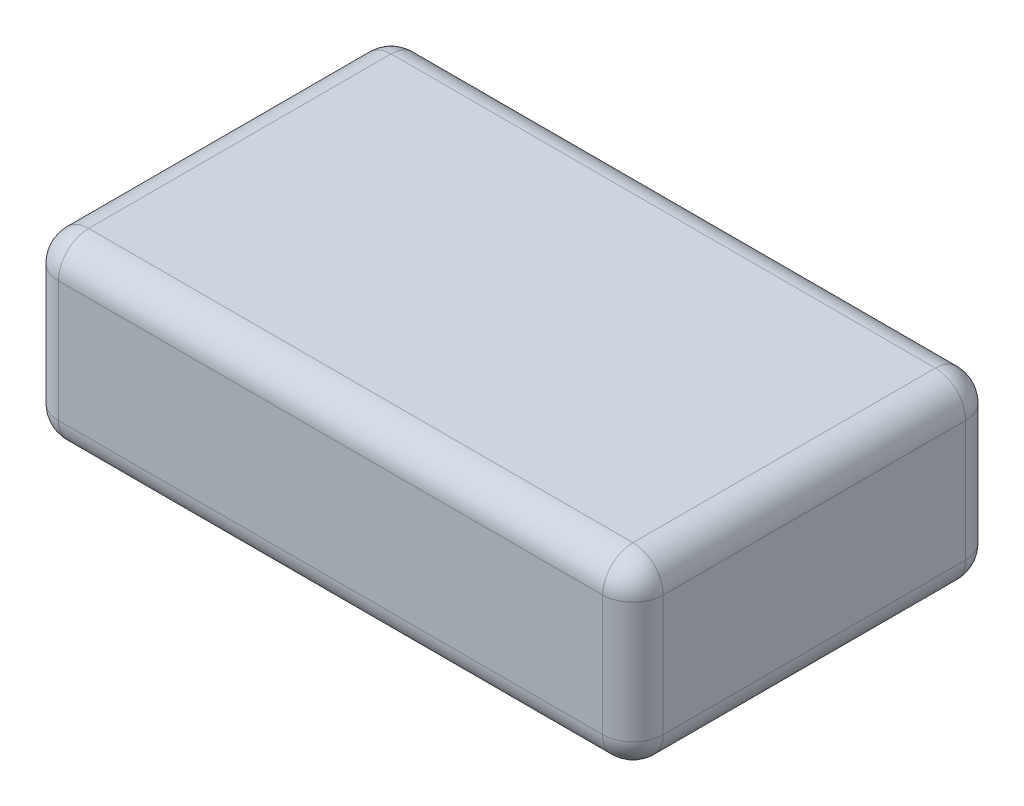
ISO-10303-21;
HEADER;
FILE_DESCRIPTION(('STEP AP214'),'2;1');
FILE_NAME('part.step','',(''),(''),'','','');
FILE_SCHEMA(('AUTOMOTIVE_DESIGN { 1 0 10303 214 1 1 1 1 }'));
ENDSEC;
DATA;
#1=APPLICATION_CONTEXT('core data for automotive mechanical design processes');
#2=APPLICATION_PROTOCOL_DEFINITION('international standard','automotive_design',2000,#1);
#3=PRODUCT_CONTEXT('',#1,'mechanical');
#4=PRODUCT('Part','Part','',(#3));
#5=PRODUCT_RELATED_PRODUCT_CATEGORY('part','',(#4));
#6=PRODUCT_DEFINITION_FORMATION('','',#4);
#7=PRODUCT_DEFINITION_CONTEXT('part definition',#1,'design');
#8=PRODUCT_DEFINITION('design','',#6,#7);
#9=PRODUCT_DEFINITION_SHAPE('','',#8);
#10=(LENGTH_UNIT() NAMED_UNIT(*) SI_UNIT(.MILLI.,.METRE.));
#11=(NAMED_UNIT(*) PLANE_ANGLE_UNIT() SI_UNIT($,.RADIAN.));
#12=(NAMED_UNIT(*) SI_UNIT($,.STERADIAN.) SOLID_ANGLE_UNIT());
#13=UNCERTAINTY_MEASURE_WITH_UNIT(LENGTH_MEASURE(1.E-05),#10,'distance_accuracy_value','');
#14=(GEOMETRIC_REPRESENTATION_CONTEXT(3) GLOBAL_UNCERTAINTY_ASSIGNED_CONTEXT((#13)) GLOBAL_UNIT_ASSIGNED_CONTEXT((#10,
#11,#12)) REPRESENTATION_CONTEXT('',''));
#15=CARTESIAN_POINT('',(0.,0.,0.));
#16=DIRECTION('',(0.,0.,1.));
#17=DIRECTION('',(1.,0.,0.));
#18=AXIS2_PLACEMENT_3D('',#15,#16,#17);
#19=CARTESIAN_POINT('',(31.75,19.05,-19.05));
#20=DIRECTION('',(-1.,0.,0.));
#21=DIRECTION('',(0.,0.,1.));
#22=AXIS2_PLACEMENT_3D('',#19,#20,#21);
#23=PLANE('',#22);
#24=DIRECTION('',(0.,-1.,0.));
#25=VECTOR('',#24,1.);
#26=CARTESIAN_POINT('',(31.75,19.05,-15.875));
#27=LINE('',#26,#25);
#28=CARTESIAN_POINT('',(31.75,3.175,-15.875));
#29=VERTEX_POINT('',#28);
#30=CARTESIAN_POINT('',(31.75,15.875,-15.875));
#31=VERTEX_POINT('',#30);
#32=EDGE_CURVE('E183',#29,#31,#27,.F.);
#33=ORIENTED_EDGE('',*,*,#32,.T.);
#34=DIRECTION('',(0.,0.,-1.));
#35=VECTOR('',#34,1.);
#36=CARTESIAN_POINT('',(31.75,15.875,19.05));
#37=LINE('',#36,#35);
#38=CARTESIAN_POINT('',(31.75,15.875,15.875));
#39=VERTEX_POINT('',#38);
#40=EDGE_CURVE('E185',#31,#39,#37,.F.);
#41=ORIENTED_EDGE('',*,*,#40,.T.);
#42=DIRECTION('',(0.,-1.,0.));
#43=VECTOR('',#42,1.);
#44=CARTESIAN_POINT('',(31.75,19.05,15.875));
#45=LINE('',#44,#43);
#46=CARTESIAN_POINT('',(31.75,3.175,15.875));
#47=VERTEX_POINT('',#46);
#48=EDGE_CURVE('E181',#39,#47,#45,.T.);
#49=ORIENTED_EDGE('',*,*,#48,.T.);
#50=DIRECTION('',(0.,0.,-1.));
#51=VECTOR('',#50,1.);
#52=CARTESIAN_POINT('',(31.75,3.175,-19.05));
#53=LINE('',#52,#51);
#54=EDGE_CURVE('E179',#47,#29,#53,.T.);
#55=ORIENTED_EDGE('',*,*,#54,.T.);
#56=EDGE_LOOP('',(#33,#41,#49,#55));
#57=FACE_BOUND('',#56,.T.);
#58=ADVANCED_FACE('F36',(#57),#23,.F.);
#59=CARTESIAN_POINT('',(-31.75,19.05,-19.05));
#60=DIRECTION('',(0.,0.,1.));
#61=DIRECTION('',(1.,0.,0.));
#62=AXIS2_PLACEMENT_3D('',#59,#60,#61);
#63=PLANE('',#62);
#64=DIRECTION('',(0.,-1.,0.));
#65=VECTOR('',#64,1.);
#66=CARTESIAN_POINT('',(-28.575,19.05,-19.05));
#67=LINE('',#66,#65);
#68=CARTESIAN_POINT('',(-28.575,3.175,-19.05));
#69=VERTEX_POINT('',#68);
#70=CARTESIAN_POINT('',(-28.575,15.875,-19.05));
#71=VERTEX_POINT('',#70);
#72=EDGE_CURVE('E174',#69,#71,#67,.F.);
#73=ORIENTED_EDGE('',*,*,#72,.T.);
#74=DIRECTION('',(-1.,0.,0.));
#75=VECTOR('',#74,1.);
#76=CARTESIAN_POINT('',(31.75,15.875,-19.05));
#77=LINE('',#76,#75);
#78=CARTESIAN_POINT('',(28.575,15.875,-19.05));
#79=VERTEX_POINT('',#78);
#80=EDGE_CURVE('E176',#71,#79,#77,.F.);
#81=ORIENTED_EDGE('',*,*,#80,.T.);
#82=DIRECTION('',(0.,-1.,0.));
#83=VECTOR('',#82,1.);
#84=CARTESIAN_POINT('',(28.575,19.05,-19.05));
#85=LINE('',#84,#83);
#86=CARTESIAN_POINT('',(28.575,3.175,-19.05));
#87=VERTEX_POINT('',#86);
#88=EDGE_CURVE('E172',#79,#87,#85,.T.);
#89=ORIENTED_EDGE('',*,*,#88,.T.);
#90=DIRECTION('',(-1.,0.,0.));
#91=VECTOR('',#90,1.);
#92=CARTESIAN_POINT('',(-31.75,3.175,-19.05));
#93=LINE('',#92,#91);
#94=EDGE_CURVE('E170',#87,#69,#93,.T.);
#95=ORIENTED_EDGE('',*,*,#94,.T.);
#96=EDGE_LOOP('',(#73,#81,#89,#95));
#97=FACE_BOUND('',#96,.T.);
#98=ADVANCED_FACE('F286',(#97),#63,.F.);
#99=CARTESIAN_POINT('',(-31.75,19.05,-19.05));
#100=DIRECTION('',(1.,0.,0.));
#101=DIRECTION('',(0.,0.,-1.));
#102=AXIS2_PLACEMENT_3D('',#99,#100,#101);
#103=PLANE('',#102);
#104=DIRECTION('',(0.,-1.,0.));
#105=VECTOR('',#104,1.);
#106=CARTESIAN_POINT('',(-31.75,19.05,15.875));
#107=LINE('',#106,#105);
#108=CARTESIAN_POINT('',(-31.75,3.175,15.875));
#109=VERTEX_POINT('',#108);
#110=CARTESIAN_POINT('',(-31.75,15.875,15.875));
#111=VERTEX_POINT('',#110);
#112=EDGE_CURVE('E161',#109,#111,#107,.F.);
#113=ORIENTED_EDGE('',*,*,#112,.T.);
#114=DIRECTION('',(0.,0.,1.));
#115=VECTOR('',#114,1.);
#116=CARTESIAN_POINT('',(-31.75,15.875,-19.05));
#117=LINE('',#116,#115);
#118=CARTESIAN_POINT('',(-31.75,15.875,-15.875));
#119=VERTEX_POINT('',#118);
#120=EDGE_CURVE('E131',#111,#119,#117,.F.);
#121=ORIENTED_EDGE('',*,*,#120,.T.);
#122=DIRECTION('',(0.,-1.,0.));
#123=VECTOR('',#122,1.);
#124=CARTESIAN_POINT('',(-31.75,19.05,-15.875));
#125=LINE('',#124,#123);
#126=CARTESIAN_POINT('',(-31.75,3.175,-15.875));
#127=VERTEX_POINT('',#126);
#128=EDGE_CURVE('E167',#119,#127,#125,.T.);
#129=ORIENTED_EDGE('',*,*,#128,.T.);
#130=DIRECTION('',(0.,0.,1.));
#131=VECTOR('',#130,1.);
#132=CARTESIAN_POINT('',(-31.75,3.175,-19.05));
#133=LINE('',#132,#131);
#134=EDGE_CURVE('E159',#127,#109,#133,.T.);
#135=ORIENTED_EDGE('',*,*,#134,.T.);
#136=EDGE_LOOP('',(#113,#121,#129,#135));
#137=FACE_BOUND('',#136,.T.);
#138=ADVANCED_FACE('F321',(#137),#103,.F.);
#139=CARTESIAN_POINT('',(-31.75,19.05,19.05));
#140=DIRECTION('',(0.,0.,-1.));
#141=DIRECTION('',(-1.,0.,0.));
#142=AXIS2_PLACEMENT_3D('',#139,#140,#141);
#143=PLANE('',#142);
#144=DIRECTION('',(1.,0.,0.));
#145=VECTOR('',#144,1.);
#146=CARTESIAN_POINT('',(-31.75,15.875,19.05));
#147=LINE('',#146,#145);
#148=CARTESIAN_POINT('',(28.575,15.875,19.05));
#149=VERTEX_POINT('',#148);
#150=CARTESIAN_POINT('',(-28.575,15.875,19.05));
#151=VERTEX_POINT('',#150);
#152=EDGE_CURVE('E192',#149,#151,#147,.F.);
#153=ORIENTED_EDGE('',*,*,#152,.T.);
#154=DIRECTION('',(0.,-1.,0.));
#155=VECTOR('',#154,1.);
#156=CARTESIAN_POINT('',(-28.575,19.05,19.05));
#157=LINE('',#156,#155);
#158=CARTESIAN_POINT('',(-28.575,3.175,19.05));
#159=VERTEX_POINT('',#158);
#160=EDGE_CURVE('E194',#151,#159,#157,.T.);
#161=ORIENTED_EDGE('',*,*,#160,.T.);
#162=DIRECTION('',(1.,0.,0.));
#163=VECTOR('',#162,1.);
#164=CARTESIAN_POINT('',(-31.75,3.175,19.05));
#165=LINE('',#164,#163);
#166=CARTESIAN_POINT('',(28.575,3.175,19.05));
#167=VERTEX_POINT('',#166);
#168=EDGE_CURVE('E188',#159,#167,#165,.T.);
#169=ORIENTED_EDGE('',*,*,#168,.T.);
#170=DIRECTION('',(0.,-1.,0.));
#171=VECTOR('',#170,1.);
#172=CARTESIAN_POINT('',(28.575,19.05,19.05));
#173=LINE('',#172,#171);
#174=EDGE_CURVE('E190',#167,#149,#173,.F.);
#175=ORIENTED_EDGE('',*,*,#174,.T.);
#176=EDGE_LOOP('',(#153,#161,#169,#175));
#177=FACE_BOUND('',#176,.T.);
#178=ADVANCED_FACE('F323',(#177),#143,.F.);
#179=CARTESIAN_POINT('',(0.,19.05,0.));
#180=DIRECTION('',(0.,1.,0.));
#181=DIRECTION('',(0.,0.,1.));
#182=AXIS2_PLACEMENT_3D('',#179,#180,#181);
#183=PLANE('',#182);
#184=DIRECTION('',(-1.,0.,0.));
#185=VECTOR('',#184,1.);
#186=CARTESIAN_POINT('',(-31.75,19.05,-15.875));
#187=LINE('',#186,#185);
#188=CARTESIAN_POINT('',(28.575,19.05,-15.875));
#189=VERTEX_POINT('',#188);
#190=CARTESIAN_POINT('',(-28.575,19.05,-15.875));
#191=VERTEX_POINT('',#190);
#192=EDGE_CURVE('E157',#189,#191,#187,.T.);
#193=ORIENTED_EDGE('',*,*,#192,.T.);
#194=DIRECTION('',(0.,0.,1.));
#195=VECTOR('',#194,1.);
#196=CARTESIAN_POINT('',(-28.575,19.05,19.05));
#197=LINE('',#196,#195);
#198=CARTESIAN_POINT('',(-28.575,19.05,15.875));
#199=VERTEX_POINT('',#198);
#200=EDGE_CURVE('E129',#191,#199,#197,.T.);
#201=ORIENTED_EDGE('',*,*,#200,.T.);
#202=DIRECTION('',(1.,0.,0.));
#203=VECTOR('',#202,1.);
#204=CARTESIAN_POINT('',(31.75,19.05,15.875));
#205=LINE('',#204,#203);
#206=CARTESIAN_POINT('',(28.575,19.05,15.875));
#207=VERTEX_POINT('',#206);
#208=EDGE_CURVE('E147',#199,#207,#205,.T.);
#209=ORIENTED_EDGE('',*,*,#208,.T.);
#210=DIRECTION('',(0.,0.,-1.));
#211=VECTOR('',#210,1.);
#212=CARTESIAN_POINT('',(28.575,19.05,-19.05));
#213=LINE('',#212,#211);
#214=EDGE_CURVE('E153',#207,#189,#213,.T.);
#215=ORIENTED_EDGE('',*,*,#214,.T.);
#216=EDGE_LOOP('',(#193,#201,#209,#215));
#217=FACE_BOUND('',#216,.T.);
#218=ADVANCED_FACE('F155',(#217),#183,.T.);
#219=CARTESIAN_POINT('',(0.,0.,0.));
#220=DIRECTION('',(0.,1.,0.));
#221=DIRECTION('',(0.,0.,1.));
#222=AXIS2_PLACEMENT_3D('',#219,#220,#221);
#223=PLANE('',#222);
#224=DIRECTION('',(0.,0.,1.));
#225=VECTOR('',#224,1.);
#226=CARTESIAN_POINT('',(-28.575,0.,0.));
#227=LINE('',#226,#225);
#228=CARTESIAN_POINT('',(-28.575,0.,15.875));
#229=VERTEX_POINT('',#228);
#230=CARTESIAN_POINT('',(-28.575,0.,-15.875));
#231=VERTEX_POINT('',#230);
#232=EDGE_CURVE('E45',#229,#231,#227,.F.);
#233=ORIENTED_EDGE('',*,*,#232,.T.);
#234=DIRECTION('',(-1.,0.,0.));
#235=VECTOR('',#234,1.);
#236=CARTESIAN_POINT('',(0.,0.,-15.875));
#237=LINE('',#236,#235);
#238=CARTESIAN_POINT('',(28.575,0.,-15.875));
#239=VERTEX_POINT('',#238);
#240=EDGE_CURVE('E11',#231,#239,#237,.F.);
#241=ORIENTED_EDGE('',*,*,#240,.T.);
#242=DIRECTION('',(0.,0.,-1.));
#243=VECTOR('',#242,1.);
#244=CARTESIAN_POINT('',(28.575,0.,0.));
#245=LINE('',#244,#243);
#246=CARTESIAN_POINT('',(28.575,0.,15.875));
#247=VERTEX_POINT('',#246);
#248=EDGE_CURVE('E197',#239,#247,#245,.F.);
#249=ORIENTED_EDGE('',*,*,#248,.T.);
#250=DIRECTION('',(1.,0.,0.));
#251=VECTOR('',#250,1.);
#252=CARTESIAN_POINT('',(0.,0.,15.875));
#253=LINE('',#252,#251);
#254=EDGE_CURVE('E56',#247,#229,#253,.F.);
#255=ORIENTED_EDGE('',*,*,#254,.T.);
#256=EDGE_LOOP('',(#233,#241,#249,#255));
#257=FACE_BOUND('',#256,.T.);
#258=ADVANCED_FACE('F266',(#257),#223,.F.);
#259=CARTESIAN_POINT('',(28.575,3.175,-19.05));
#260=DIRECTION('',(0.,0.,-1.));
#261=DIRECTION('',(-1.,0.,0.));
#262=AXIS2_PLACEMENT_3D('',#259,#260,#261);
#263=CYLINDRICAL_SURFACE('',#262,3.175);
#264=CARTESIAN_POINT('',(28.575,3.175,-15.875));
#265=DIRECTION('',(0.,0.,-1.));
#266=DIRECTION('',(-1.,0.,0.));
#267=AXIS2_PLACEMENT_3D('',#264,#265,#266);
#268=CIRCLE('',#267,3.175);
#269=EDGE_CURVE('E40',#29,#239,#268,.T.);
#270=ORIENTED_EDGE('',*,*,#269,.F.);
#271=ORIENTED_EDGE('',*,*,#54,.F.);
#272=CARTESIAN_POINT('',(28.575,3.175,15.875));
#273=DIRECTION('',(0.,0.,1.));
#274=DIRECTION('',(1.,0.,0.));
#275=AXIS2_PLACEMENT_3D('',#272,#273,#274);
#276=CIRCLE('',#275,3.175);
#277=EDGE_CURVE('E249',#247,#47,#276,.T.);
#278=ORIENTED_EDGE('',*,*,#277,.F.);
#279=ORIENTED_EDGE('',*,*,#248,.F.);
#280=EDGE_LOOP('',(#270,#271,#278,#279));
#281=FACE_BOUND('',#280,.T.);
#282=ADVANCED_FACE('F38',(#281),#263,.T.);
#283=CARTESIAN_POINT('',(28.575,3.175,-15.875));
#284=DIRECTION('',(0.,-1.,0.));
#285=DIRECTION('',(0.,0.,-1.));
#286=AXIS2_PLACEMENT_3D('',#283,#284,#285);
#287=SPHERICAL_SURFACE('',#286,3.175);
#288=CARTESIAN_POINT('',(28.575,3.175,-15.875));
#289=DIRECTION('',(0.,-1.,0.));
#290=DIRECTION('',(0.,0.,-1.));
#291=AXIS2_PLACEMENT_3D('',#288,#289,#290);
#292=CIRCLE('',#291,3.175);
#293=EDGE_CURVE('E245',#29,#87,#292,.F.);
#294=ORIENTED_EDGE('',*,*,#293,.F.);
#295=ORIENTED_EDGE('',*,*,#269,.T.);
#296=CARTESIAN_POINT('',(28.575,3.175,-15.875));
#297=DIRECTION('',(1.,0.,0.));
#298=DIRECTION('',(0.,0.,-1.));
#299=AXIS2_PLACEMENT_3D('',#296,#297,#298);
#300=CIRCLE('',#299,3.175);
#301=EDGE_CURVE('E248',#87,#239,#300,.F.);
#302=ORIENTED_EDGE('',*,*,#301,.F.);
#303=EDGE_LOOP('',(#294,#295,#302));
#304=FACE_BOUND('',#303,.T.);
#305=ADVANCED_FACE('F261',(#304),#287,.T.);
#306=CARTESIAN_POINT('',(28.575,3.175,15.875));
#307=DIRECTION('',(1.,0.,0.));
#308=DIRECTION('',(0.,0.,-1.));
#309=AXIS2_PLACEMENT_3D('',#306,#307,#308);
#310=SPHERICAL_SURFACE('',#309,3.175);
#311=CARTESIAN_POINT('',(28.575,3.175,15.875));
#312=DIRECTION('',(1.,0.,0.));
#313=DIRECTION('',(0.,0.,-1.));
#314=AXIS2_PLACEMENT_3D('',#311,#312,#313);
#315=CIRCLE('',#314,3.175);
#316=EDGE_CURVE('E239',#247,#167,#315,.F.);
#317=ORIENTED_EDGE('',*,*,#316,.F.);
#318=ORIENTED_EDGE('',*,*,#277,.T.);
#319=CARTESIAN_POINT('',(28.575,3.175,15.875));
#320=DIRECTION('',(0.,-1.,0.));
#321=DIRECTION('',(0.,0.,-1.));
#322=AXIS2_PLACEMENT_3D('',#319,#320,#321);
#323=CIRCLE('',#322,3.175);
#324=EDGE_CURVE('E242',#167,#47,#323,.F.);
#325=ORIENTED_EDGE('',*,*,#324,.F.);
#326=EDGE_LOOP('',(#317,#318,#325));
#327=FACE_BOUND('',#326,.T.);
#328=ADVANCED_FACE('F309',(#327),#310,.T.);
#329=CARTESIAN_POINT('',(-31.75,3.175,-15.875));
#330=DIRECTION('',(-1.,0.,0.));
#331=DIRECTION('',(0.,0.,1.));
#332=AXIS2_PLACEMENT_3D('',#329,#330,#331);
#333=CYLINDRICAL_SURFACE('',#332,3.175);
#334=ORIENTED_EDGE('',*,*,#301,.T.);
#335=ORIENTED_EDGE('',*,*,#240,.F.);
#336=CARTESIAN_POINT('',(-28.575,3.175,-15.875));
#337=DIRECTION('',(-1.,0.,0.));
#338=DIRECTION('',(0.,0.,1.));
#339=AXIS2_PLACEMENT_3D('',#336,#337,#338);
#340=CIRCLE('',#339,3.175);
#341=EDGE_CURVE('E233',#69,#231,#340,.T.);
#342=ORIENTED_EDGE('',*,*,#341,.F.);
#343=ORIENTED_EDGE('',*,*,#94,.F.);
#344=EDGE_LOOP('',(#334,#335,#342,#343));
#345=FACE_BOUND('',#344,.T.);
#346=ADVANCED_FACE('F270',(#345),#333,.T.);
#347=CARTESIAN_POINT('',(28.575,19.05,-15.875));
#348=DIRECTION('',(0.,-1.,0.));
#349=DIRECTION('',(0.,0.,-1.));
#350=AXIS2_PLACEMENT_3D('',#347,#348,#349);
#351=CYLINDRICAL_SURFACE('',#350,3.175);
#352=ORIENTED_EDGE('',*,*,#293,.T.);
#353=ORIENTED_EDGE('',*,*,#88,.F.);
#354=CARTESIAN_POINT('',(28.575,15.875,-15.875));
#355=DIRECTION('',(0.,1.,0.));
#356=DIRECTION('',(0.,0.,1.));
#357=AXIS2_PLACEMENT_3D('',#354,#355,#356);
#358=CIRCLE('',#357,3.175);
#359=EDGE_CURVE('E230',#31,#79,#358,.T.);
#360=ORIENTED_EDGE('',*,*,#359,.F.);
#361=ORIENTED_EDGE('',*,*,#32,.F.);
#362=EDGE_LOOP('',(#352,#353,#360,#361));
#363=FACE_BOUND('',#362,.T.);
#364=ADVANCED_FACE('F297',(#363),#351,.T.);
#365=CARTESIAN_POINT('',(28.575,15.875,0.));
#366=DIRECTION('',(0.,0.,1.));
#367=DIRECTION('',(1.,0.,0.));
#368=AXIS2_PLACEMENT_3D('',#365,#366,#367);
#369=CYLINDRICAL_SURFACE('',#368,3.175);
#370=CARTESIAN_POINT('',(28.575,15.875,15.875));
#371=DIRECTION('',(0.,0.,1.));
#372=DIRECTION('',(0.,-1.,0.));
#373=AXIS2_PLACEMENT_3D('',#370,#371,#372);
#374=CIRCLE('',#373,3.175);
#375=EDGE_CURVE('E224',#39,#207,#374,.T.);
#376=ORIENTED_EDGE('',*,*,#375,.F.);
#377=ORIENTED_EDGE('',*,*,#40,.F.);
#378=CARTESIAN_POINT('',(28.575,15.875,-15.875));
#379=DIRECTION('',(0.,0.,-1.));
#380=DIRECTION('',(-1.,0.,0.));
#381=AXIS2_PLACEMENT_3D('',#378,#379,#380);
#382=CIRCLE('',#381,3.175);
#383=EDGE_CURVE('E227',#189,#31,#382,.T.);
#384=ORIENTED_EDGE('',*,*,#383,.F.);
#385=ORIENTED_EDGE('',*,*,#214,.F.);
#386=EDGE_LOOP('',(#376,#377,#384,#385));
#387=FACE_BOUND('',#386,.T.);
#388=ADVANCED_FACE('F302',(#387),#369,.T.);
#389=CARTESIAN_POINT('',(28.575,19.05,15.875));
#390=DIRECTION('',(0.,-1.,0.));
#391=DIRECTION('',(0.,0.,-1.));
#392=AXIS2_PLACEMENT_3D('',#389,#390,#391);
#393=CYLINDRICAL_SURFACE('',#392,3.175);
#394=ORIENTED_EDGE('',*,*,#324,.T.);
#395=ORIENTED_EDGE('',*,*,#48,.F.);
#396=CARTESIAN_POINT('',(28.575,15.875,15.875));
#397=DIRECTION('',(0.,1.,0.));
#398=DIRECTION('',(0.,0.,1.));
#399=AXIS2_PLACEMENT_3D('',#396,#397,#398);
#400=CIRCLE('',#399,3.175);
#401=EDGE_CURVE('E222',#149,#39,#400,.T.);
#402=ORIENTED_EDGE('',*,*,#401,.F.);
#403=ORIENTED_EDGE('',*,*,#174,.F.);
#404=EDGE_LOOP('',(#394,#395,#402,#403));
#405=FACE_BOUND('',#404,.T.);
#406=ADVANCED_FACE('F307',(#405),#393,.T.);
#407=CARTESIAN_POINT('',(-31.75,3.175,15.875));
#408=DIRECTION('',(1.,0.,0.));
#409=DIRECTION('',(0.,0.,-1.));
#410=AXIS2_PLACEMENT_3D('',#407,#408,#409);
#411=CYLINDRICAL_SURFACE('',#410,3.175);
#412=ORIENTED_EDGE('',*,*,#316,.T.);
#413=ORIENTED_EDGE('',*,*,#168,.F.);
#414=CARTESIAN_POINT('',(-28.575,3.175,15.875));
#415=DIRECTION('',(-1.,0.,0.));
#416=DIRECTION('',(0.,0.,1.));
#417=AXIS2_PLACEMENT_3D('',#414,#415,#416);
#418=CIRCLE('',#417,3.175);
#419=EDGE_CURVE('E219',#229,#159,#418,.T.);
#420=ORIENTED_EDGE('',*,*,#419,.F.);
#421=ORIENTED_EDGE('',*,*,#254,.F.);
#422=EDGE_LOOP('',(#412,#413,#420,#421));
#423=FACE_BOUND('',#422,.T.);
#424=ADVANCED_FACE('F312',(#423),#411,.T.);
#425=CARTESIAN_POINT('',(-28.575,3.175,-19.05));
#426=DIRECTION('',(0.,0.,1.));
#427=DIRECTION('',(1.,0.,0.));
#428=AXIS2_PLACEMENT_3D('',#425,#426,#427);
#429=CYLINDRICAL_SURFACE('',#428,3.175);
#430=CARTESIAN_POINT('',(-28.575,3.175,-15.875));
#431=DIRECTION('',(0.,0.,-1.));
#432=DIRECTION('',(-1.,0.,0.));
#433=AXIS2_PLACEMENT_3D('',#430,#431,#432);
#434=CIRCLE('',#433,3.175);
#435=EDGE_CURVE('E236',#231,#127,#434,.T.);
#436=ORIENTED_EDGE('',*,*,#435,.F.);
#437=ORIENTED_EDGE('',*,*,#232,.F.);
#438=CARTESIAN_POINT('',(-28.575,3.175,15.875));
#439=DIRECTION('',(0.,0.,1.));
#440=DIRECTION('',(1.,0.,0.));
#441=AXIS2_PLACEMENT_3D('',#438,#439,#440);
#442=CIRCLE('',#441,3.175);
#443=EDGE_CURVE('E216',#109,#229,#442,.T.);
#444=ORIENTED_EDGE('',*,*,#443,.F.);
#445=ORIENTED_EDGE('',*,*,#134,.F.);
#446=EDGE_LOOP('',(#436,#437,#444,#445));
#447=FACE_BOUND('',#446,.T.);
#448=ADVANCED_FACE('F274',(#447),#429,.T.);
#449=CARTESIAN_POINT('',(-28.575,3.175,-15.875));
#450=DIRECTION('',(0.,-1.,0.));
#451=DIRECTION('',(0.,0.,-1.));
#452=AXIS2_PLACEMENT_3D('',#449,#450,#451);
#453=SPHERICAL_SURFACE('',#452,3.175);
#454=ORIENTED_EDGE('',*,*,#341,.T.);
#455=ORIENTED_EDGE('',*,*,#435,.T.);
#456=CARTESIAN_POINT('',(-28.575,3.175,-15.875));
#457=DIRECTION('',(0.,-1.,0.));
#458=DIRECTION('',(0.,0.,-1.));
#459=AXIS2_PLACEMENT_3D('',#456,#457,#458);
#460=CIRCLE('',#459,3.175);
#461=EDGE_CURVE('E213',#69,#127,#460,.F.);
#462=ORIENTED_EDGE('',*,*,#461,.F.);
#463=EDGE_LOOP('',(#454,#455,#462));
#464=FACE_BOUND('',#463,.T.);
#465=ADVANCED_FACE('F278',(#464),#453,.T.);
#466=CARTESIAN_POINT('',(28.575,15.875,-15.875));
#467=DIRECTION('',(1.,0.,0.));
#468=DIRECTION('',(0.,0.,-1.));
#469=AXIS2_PLACEMENT_3D('',#466,#467,#468);
#470=SPHERICAL_SURFACE('',#469,3.175);
#471=ORIENTED_EDGE('',*,*,#383,.T.);
#472=ORIENTED_EDGE('',*,*,#359,.T.);
#473=CARTESIAN_POINT('',(28.575,15.875,-15.875));
#474=DIRECTION('',(1.,0.,0.));
#475=DIRECTION('',(0.,1.,0.));
#476=AXIS2_PLACEMENT_3D('',#473,#474,#475);
#477=CIRCLE('',#476,3.175);
#478=EDGE_CURVE('E211',#189,#79,#477,.F.);
#479=ORIENTED_EDGE('',*,*,#478,.F.);
#480=EDGE_LOOP('',(#471,#472,#479));
#481=FACE_BOUND('',#480,.T.);
#482=ADVANCED_FACE('F294',(#481),#470,.T.);
#483=CARTESIAN_POINT('',(28.575,15.875,15.875));
#484=DIRECTION('',(1.,0.,0.));
#485=DIRECTION('',(0.,0.,-1.));
#486=AXIS2_PLACEMENT_3D('',#483,#484,#485);
#487=SPHERICAL_SURFACE('',#486,3.175);
#488=ORIENTED_EDGE('',*,*,#401,.T.);
#489=ORIENTED_EDGE('',*,*,#375,.T.);
#490=CARTESIAN_POINT('',(28.575,15.875,15.875));
#491=DIRECTION('',(1.,0.,0.));
#492=DIRECTION('',(0.,0.,-1.));
#493=AXIS2_PLACEMENT_3D('',#490,#491,#492);
#494=CIRCLE('',#493,3.175);
#495=EDGE_CURVE('E150',#149,#207,#494,.F.);
#496=ORIENTED_EDGE('',*,*,#495,.F.);
#497=EDGE_LOOP('',(#488,#489,#496));
#498=FACE_BOUND('',#497,.T.);
#499=ADVANCED_FACE('F355',(#498),#487,.T.);
#500=CARTESIAN_POINT('',(-28.575,3.175,15.875));
#501=DIRECTION('',(0.,-1.,0.));
#502=DIRECTION('',(0.,0.,-1.));
#503=AXIS2_PLACEMENT_3D('',#500,#501,#502);
#504=SPHERICAL_SURFACE('',#503,3.175);
#505=ORIENTED_EDGE('',*,*,#443,.T.);
#506=ORIENTED_EDGE('',*,*,#419,.T.);
#507=CARTESIAN_POINT('',(-28.575,3.175,15.875));
#508=DIRECTION('',(0.,-1.,0.));
#509=DIRECTION('',(0.,0.,-1.));
#510=AXIS2_PLACEMENT_3D('',#507,#508,#509);
#511=CIRCLE('',#510,3.175);
#512=EDGE_CURVE('E208',#109,#159,#511,.F.);
#513=ORIENTED_EDGE('',*,*,#512,.F.);
#514=EDGE_LOOP('',(#505,#506,#513));
#515=FACE_BOUND('',#514,.T.);
#516=ADVANCED_FACE('F315',(#515),#504,.T.);
#517=CARTESIAN_POINT('',(-28.575,19.05,-15.875));
#518=DIRECTION('',(0.,-1.,0.));
#519=DIRECTION('',(0.,0.,-1.));
#520=AXIS2_PLACEMENT_3D('',#517,#518,#519);
#521=CYLINDRICAL_SURFACE('',#520,3.175);
#522=ORIENTED_EDGE('',*,*,#461,.T.);
#523=ORIENTED_EDGE('',*,*,#128,.F.);
#524=CARTESIAN_POINT('',(-28.575,15.875,-15.875));
#525=DIRECTION('',(0.,1.,0.));
#526=DIRECTION('',(0.,0.,1.));
#527=AXIS2_PLACEMENT_3D('',#524,#525,#526);
#528=CIRCLE('',#527,3.175);
#529=EDGE_CURVE('E205',#71,#119,#528,.T.);
#530=ORIENTED_EDGE('',*,*,#529,.F.);
#531=ORIENTED_EDGE('',*,*,#72,.F.);
#532=EDGE_LOOP('',(#522,#523,#530,#531));
#533=FACE_BOUND('',#532,.T.);
#534=ADVANCED_FACE('F283',(#533),#521,.T.);
#535=CARTESIAN_POINT('',(0.,15.875,-15.875));
#536=DIRECTION('',(1.,0.,0.));
#537=DIRECTION('',(0.,0.,-1.));
#538=AXIS2_PLACEMENT_3D('',#535,#536,#537);
#539=CYLINDRICAL_SURFACE('',#538,3.175);
#540=ORIENTED_EDGE('',*,*,#478,.T.);
#541=ORIENTED_EDGE('',*,*,#80,.F.);
#542=CARTESIAN_POINT('',(-28.575,15.875,-15.875));
#543=DIRECTION('',(-1.,0.,0.));
#544=DIRECTION('',(0.,0.,1.));
#545=AXIS2_PLACEMENT_3D('',#542,#543,#544);
#546=CIRCLE('',#545,3.175);
#547=EDGE_CURVE('E144',#191,#71,#546,.T.);
#548=ORIENTED_EDGE('',*,*,#547,.F.);
#549=ORIENTED_EDGE('',*,*,#192,.F.);
#550=EDGE_LOOP('',(#540,#541,#548,#549));
#551=FACE_BOUND('',#550,.T.);
#552=ADVANCED_FACE('F288',(#551),#539,.T.);
#553=CARTESIAN_POINT('',(0.,15.875,15.875));
#554=DIRECTION('',(-1.,0.,0.));
#555=DIRECTION('',(0.,0.,1.));
#556=AXIS2_PLACEMENT_3D('',#553,#554,#555);
#557=CYLINDRICAL_SURFACE('',#556,3.175);
#558=ORIENTED_EDGE('',*,*,#495,.T.);
#559=ORIENTED_EDGE('',*,*,#208,.F.);
#560=CARTESIAN_POINT('',(-28.575,15.875,15.875));
#561=DIRECTION('',(-1.,0.,0.));
#562=DIRECTION('',(0.,0.,1.));
#563=AXIS2_PLACEMENT_3D('',#560,#561,#562);
#564=CIRCLE('',#563,3.175);
#565=EDGE_CURVE('E137',#151,#199,#564,.T.);
#566=ORIENTED_EDGE('',*,*,#565,.F.);
#567=ORIENTED_EDGE('',*,*,#152,.F.);
#568=EDGE_LOOP('',(#558,#559,#566,#567));
#569=FACE_BOUND('',#568,.T.);
#570=ADVANCED_FACE('F148',(#569),#557,.T.);
#571=CARTESIAN_POINT('',(-28.575,19.05,15.875));
#572=DIRECTION('',(0.,-1.,0.));
#573=DIRECTION('',(0.,0.,-1.));
#574=AXIS2_PLACEMENT_3D('',#571,#572,#573);
#575=CYLINDRICAL_SURFACE('',#574,3.175);
#576=ORIENTED_EDGE('',*,*,#512,.T.);
#577=ORIENTED_EDGE('',*,*,#160,.F.);
#578=CARTESIAN_POINT('',(-28.575,15.875,15.875));
#579=DIRECTION('',(0.,1.,0.));
#580=DIRECTION('',(0.,0.,1.));
#581=AXIS2_PLACEMENT_3D('',#578,#579,#580);
#582=CIRCLE('',#581,3.175);
#583=EDGE_CURVE('E141',#111,#151,#582,.T.);
#584=ORIENTED_EDGE('',*,*,#583,.F.);
#585=ORIENTED_EDGE('',*,*,#112,.F.);
#586=EDGE_LOOP('',(#576,#577,#584,#585));
#587=FACE_BOUND('',#586,.T.);
#588=ADVANCED_FACE('F319',(#587),#575,.T.);
#589=CARTESIAN_POINT('',(-28.575,15.875,-15.875));
#590=DIRECTION('',(0.,0.,-1.));
#591=DIRECTION('',(-1.,0.,0.));
#592=AXIS2_PLACEMENT_3D('',#589,#590,#591);
#593=SPHERICAL_SURFACE('',#592,3.175);
#594=ORIENTED_EDGE('',*,*,#547,.T.);
#595=ORIENTED_EDGE('',*,*,#529,.T.);
#596=CARTESIAN_POINT('',(-28.575,15.875,-15.875));
#597=DIRECTION('',(0.,0.,-1.));
#598=DIRECTION('',(-1.,0.,0.));
#599=AXIS2_PLACEMENT_3D('',#596,#597,#598);
#600=CIRCLE('',#599,3.175);
#601=EDGE_CURVE('E134',#191,#119,#600,.F.);
#602=ORIENTED_EDGE('',*,*,#601,.F.);
#603=EDGE_LOOP('',(#594,#595,#602));
#604=FACE_BOUND('',#603,.T.);
#605=ADVANCED_FACE('F341',(#604),#593,.T.);
#606=CARTESIAN_POINT('',(-28.575,15.875,15.875));
#607=DIRECTION('',(0.,0.,1.));
#608=DIRECTION('',(1.,0.,0.));
#609=AXIS2_PLACEMENT_3D('',#606,#607,#608);
#610=SPHERICAL_SURFACE('',#609,3.175);
#611=ORIENTED_EDGE('',*,*,#583,.T.);
#612=ORIENTED_EDGE('',*,*,#565,.T.);
#613=CARTESIAN_POINT('',(-28.575,15.875,15.875));
#614=DIRECTION('',(0.,0.,1.));
#615=DIRECTION('',(1.,0.,0.));
#616=AXIS2_PLACEMENT_3D('',#613,#614,#615);
#617=CIRCLE('',#616,3.175);
#618=EDGE_CURVE('E125',#111,#199,#617,.F.);
#619=ORIENTED_EDGE('',*,*,#618,.F.);
#620=EDGE_LOOP('',(#611,#612,#619));
#621=FACE_BOUND('',#620,.T.);
#622=ADVANCED_FACE('F139',(#621),#610,.T.);
#623=CARTESIAN_POINT('',(-28.575,15.875,0.));
#624=DIRECTION('',(0.,0.,-1.));
#625=DIRECTION('',(-1.,0.,0.));
#626=AXIS2_PLACEMENT_3D('',#623,#624,#625);
#627=CYLINDRICAL_SURFACE('',#626,3.175);
#628=ORIENTED_EDGE('',*,*,#601,.T.);
#629=ORIENTED_EDGE('',*,*,#120,.F.);
#630=ORIENTED_EDGE('',*,*,#618,.T.);
#631=ORIENTED_EDGE('',*,*,#200,.F.);
#632=EDGE_LOOP('',(#628,#629,#630,#631));
#633=FACE_BOUND('',#632,.T.);
#634=ADVANCED_FACE('F127',(#633),#627,.T.);
#635=CLOSED_SHELL('',(#58,#98,#138,#178,#218,#258,#282,#305,#328,#346,#364,#388,#406,#424,#448,
#465,#482,#499,#516,#534,#552,#570,#588,#605,#622,#634));
#636=MANIFOLD_SOLID_BREP('B2',#635);
#637=ADVANCED_BREP_SHAPE_REPRESENTATION('',(#18,#636),#14);
#638=SHAPE_DEFINITION_REPRESENTATION(#9,#637);
ENDSEC;
END-ISO-10303-21;
